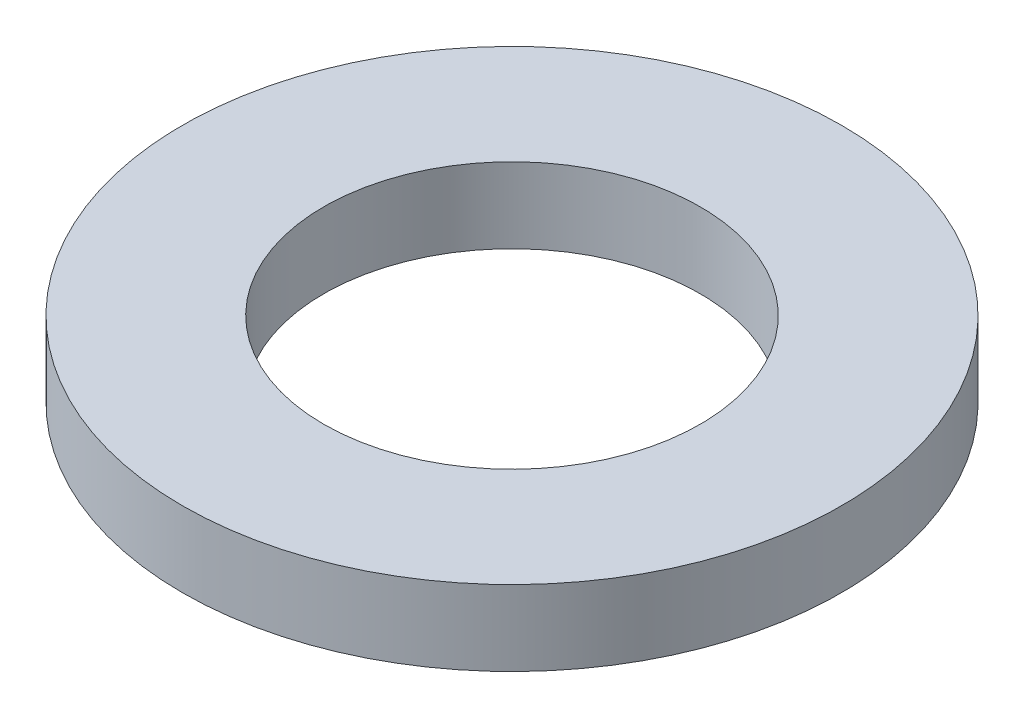
ISO-10303-21;
HEADER;
FILE_DESCRIPTION(('STEP AP214'),'2;1');
FILE_NAME('part.step','',(''),(''),'','','');
FILE_SCHEMA(('AUTOMOTIVE_DESIGN { 1 0 10303 214 1 1 1 1 }'));
ENDSEC;
DATA;
#1=APPLICATION_CONTEXT('core data for automotive mechanical design processes');
#2=APPLICATION_PROTOCOL_DEFINITION('international standard','automotive_design',2000,#1);
#3=PRODUCT_CONTEXT('',#1,'mechanical');
#4=PRODUCT('Part','Part','',(#3));
#5=PRODUCT_RELATED_PRODUCT_CATEGORY('part','',(#4));
#6=PRODUCT_DEFINITION_FORMATION('','',#4);
#7=PRODUCT_DEFINITION_CONTEXT('part definition',#1,'design');
#8=PRODUCT_DEFINITION('design','',#6,#7);
#9=PRODUCT_DEFINITION_SHAPE('','',#8);
#10=(LENGTH_UNIT() NAMED_UNIT(*) SI_UNIT(.MILLI.,.METRE.));
#11=(NAMED_UNIT(*) PLANE_ANGLE_UNIT() SI_UNIT($,.RADIAN.));
#12=(NAMED_UNIT(*) SI_UNIT($,.STERADIAN.) SOLID_ANGLE_UNIT());
#13=UNCERTAINTY_MEASURE_WITH_UNIT(LENGTH_MEASURE(1.E-05),#10,'distance_accuracy_value','');
#14=(GEOMETRIC_REPRESENTATION_CONTEXT(3) GLOBAL_UNCERTAINTY_ASSIGNED_CONTEXT((#13)) GLOBAL_UNIT_ASSIGNED_CONTEXT((#10,
#11,#12)) REPRESENTATION_CONTEXT('',''));
#15=CARTESIAN_POINT('',(0.,0.,0.));
#16=DIRECTION('',(0.,0.,1.));
#17=DIRECTION('',(1.,0.,0.));
#18=AXIS2_PLACEMENT_3D('',#15,#16,#17);
#19=CARTESIAN_POINT('',(0.,4.,0.));
#20=DIRECTION('',(0.,1.,0.));
#21=DIRECTION('',(0.,0.,1.));
#22=AXIS2_PLACEMENT_3D('',#19,#20,#21);
#23=PLANE('',#22);
#24=CARTESIAN_POINT('',(0.,4.,0.));
#25=DIRECTION('',(0.,1.,0.));
#26=DIRECTION('',(0.,0.,1.));
#27=AXIS2_PLACEMENT_3D('',#24,#25,#26);
#28=CIRCLE('',#27,17.5);
#29=CARTESIAN_POINT('',(0.,4.,17.5));
#30=VERTEX_POINT('',#29);
#31=EDGE_CURVE('E10',#30,#30,#28,.T.);
#32=ORIENTED_EDGE('',*,*,#31,.T.);
#33=EDGE_LOOP('',(#32));
#34=FACE_BOUND('',#33,.T.);
#35=CARTESIAN_POINT('',(0.,4.,0.));
#36=DIRECTION('',(0.,1.,0.));
#37=DIRECTION('',(0.,0.,1.));
#38=AXIS2_PLACEMENT_3D('',#35,#36,#37);
#39=CIRCLE('',#38,10.);
#40=CARTESIAN_POINT('',(0.,4.,10.));
#41=VERTEX_POINT('',#40);
#42=EDGE_CURVE('E50',#41,#41,#39,.T.);
#43=ORIENTED_EDGE('',*,*,#42,.F.);
#44=EDGE_LOOP('',(#43));
#45=FACE_BOUND('',#44,.T.);
#46=ADVANCED_FACE('F39',(#34,#45),#23,.T.);
#47=CARTESIAN_POINT('',(0.,0.,0.));
#48=DIRECTION('',(0.,1.,0.));
#49=DIRECTION('',(0.,0.,1.));
#50=AXIS2_PLACEMENT_3D('',#47,#48,#49);
#51=PLANE('',#50);
#52=CARTESIAN_POINT('',(0.,0.,0.));
#53=DIRECTION('',(0.,1.,0.));
#54=DIRECTION('',(0.,0.,1.));
#55=AXIS2_PLACEMENT_3D('',#52,#53,#54);
#56=CIRCLE('',#55,17.5);
#57=CARTESIAN_POINT('',(0.,0.,17.5));
#58=VERTEX_POINT('',#57);
#59=EDGE_CURVE('E43',#58,#58,#56,.T.);
#60=ORIENTED_EDGE('',*,*,#59,.F.);
#61=EDGE_LOOP('',(#60));
#62=FACE_BOUND('',#61,.T.);
#63=CARTESIAN_POINT('',(0.,0.,0.));
#64=DIRECTION('',(0.,1.,0.));
#65=DIRECTION('',(0.,0.,1.));
#66=AXIS2_PLACEMENT_3D('',#63,#64,#65);
#67=CIRCLE('',#66,10.);
#68=CARTESIAN_POINT('',(0.,0.,10.));
#69=VERTEX_POINT('',#68);
#70=EDGE_CURVE('E52',#69,#69,#67,.T.);
#71=ORIENTED_EDGE('',*,*,#70,.T.);
#72=EDGE_LOOP('',(#71));
#73=FACE_BOUND('',#72,.T.);
#74=ADVANCED_FACE('F62',(#62,#73),#51,.F.);
#75=CARTESIAN_POINT('',(0.,4.,0.));
#76=DIRECTION('',(0.,-1.,0.));
#77=DIRECTION('',(0.,0.,-1.));
#78=AXIS2_PLACEMENT_3D('',#75,#76,#77);
#79=CYLINDRICAL_SURFACE('',#78,17.5);
#80=ORIENTED_EDGE('',*,*,#31,.F.);
#81=EDGE_LOOP('',(#80));
#82=FACE_BOUND('',#81,.T.);
#83=ORIENTED_EDGE('',*,*,#59,.T.);
#84=EDGE_LOOP('',(#83));
#85=FACE_BOUND('',#84,.T.);
#86=ADVANCED_FACE('F41',(#82,#85),#79,.T.);
#87=CARTESIAN_POINT('',(0.,4.,0.));
#88=DIRECTION('',(0.,-1.,0.));
#89=DIRECTION('',(0.,0.,-1.));
#90=AXIS2_PLACEMENT_3D('',#87,#88,#89);
#91=CYLINDRICAL_SURFACE('',#90,10.);
#92=ORIENTED_EDGE('',*,*,#42,.T.);
#93=EDGE_LOOP('',(#92));
#94=FACE_BOUND('',#93,.T.);
#95=ORIENTED_EDGE('',*,*,#70,.F.);
#96=EDGE_LOOP('',(#95));
#97=FACE_BOUND('',#96,.T.);
#98=ADVANCED_FACE('F58',(#94,#97),#91,.F.);
#99=CLOSED_SHELL('',(#46,#74,#86,#98));
#100=MANIFOLD_SOLID_BREP('B2',#99);
#101=ADVANCED_BREP_SHAPE_REPRESENTATION('',(#18,#100),#14);
#102=SHAPE_DEFINITION_REPRESENTATION(#9,#101);
ENDSEC;
END-ISO-10303-21;
